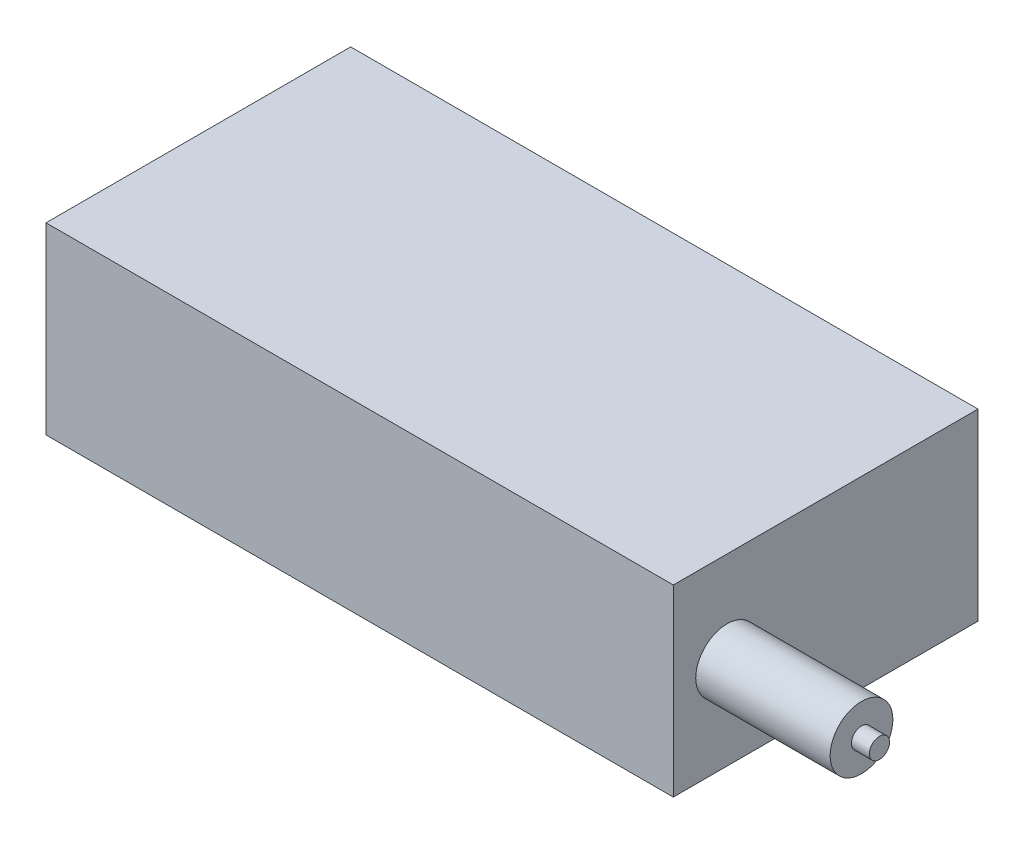
ISO-10303-21;
HEADER;
FILE_DESCRIPTION(('STEP AP214'),'2;1');
FILE_NAME('part.step','',(''),(''),'','','');
FILE_SCHEMA(('AUTOMOTIVE_DESIGN { 1 0 10303 214 1 1 1 1 }'));
ENDSEC;
DATA;
#1=APPLICATION_CONTEXT('core data for automotive mechanical design processes');
#2=APPLICATION_PROTOCOL_DEFINITION('international standard','automotive_design',2000,#1);
#3=PRODUCT_CONTEXT('',#1,'mechanical');
#4=PRODUCT('Part','Part','',(#3));
#5=PRODUCT_RELATED_PRODUCT_CATEGORY('part','',(#4));
#6=PRODUCT_DEFINITION_FORMATION('','',#4);
#7=PRODUCT_DEFINITION_CONTEXT('part definition',#1,'design');
#8=PRODUCT_DEFINITION('design','',#6,#7);
#9=PRODUCT_DEFINITION_SHAPE('','',#8);
#10=(LENGTH_UNIT() NAMED_UNIT(*) SI_UNIT(.MILLI.,.METRE.));
#11=(NAMED_UNIT(*) PLANE_ANGLE_UNIT() SI_UNIT($,.RADIAN.));
#12=(NAMED_UNIT(*) SI_UNIT($,.STERADIAN.) SOLID_ANGLE_UNIT());
#13=UNCERTAINTY_MEASURE_WITH_UNIT(LENGTH_MEASURE(1.E-05),#10,'distance_accuracy_value','');
#14=(GEOMETRIC_REPRESENTATION_CONTEXT(3) GLOBAL_UNCERTAINTY_ASSIGNED_CONTEXT((#13)) GLOBAL_UNIT_ASSIGNED_CONTEXT((#10,
#11,#12)) REPRESENTATION_CONTEXT('',''));
#15=CARTESIAN_POINT('',(0.,0.,0.));
#16=DIRECTION('',(0.,0.,1.));
#17=DIRECTION('',(1.,0.,0.));
#18=AXIS2_PLACEMENT_3D('',#15,#16,#17);
#19=CARTESIAN_POINT('',(0.,32.54375,0.));
#20=DIRECTION('',(1.,0.,0.));
#21=DIRECTION('',(0.,0.,-1.));
#22=AXIS2_PLACEMENT_3D('',#19,#20,#21);
#23=PLANE('',#22);
#24=DIRECTION('',(0.,0.,-1.));
#25=VECTOR('',#24,1.);
#26=CARTESIAN_POINT('',(0.,25.4,-18.25625));
#27=LINE('',#26,#25);
#28=CARTESIAN_POINT('',(0.,25.4,-18.25625));
#29=VERTEX_POINT('',#28);
#30=CARTESIAN_POINT('',(0.,25.4,-46.0375));
#31=VERTEX_POINT('',#30);
#32=EDGE_CURVE('E138',#29,#31,#27,.T.);
#33=ORIENTED_EDGE('',*,*,#32,.F.);
#34=DIRECTION('',(0.,1.,0.));
#35=VECTOR('',#34,1.);
#36=CARTESIAN_POINT('',(0.,6.35,-18.25625));
#37=LINE('',#36,#35);
#38=CARTESIAN_POINT('',(0.,6.35,-18.25625));
#39=VERTEX_POINT('',#38);
#40=EDGE_CURVE('E47',#39,#29,#37,.T.);
#41=ORIENTED_EDGE('',*,*,#40,.F.);
#42=DIRECTION('',(0.,0.,1.));
#43=VECTOR('',#42,1.);
#44=CARTESIAN_POINT('',(0.,6.35,-18.25625));
#45=LINE('',#44,#43);
#46=CARTESIAN_POINT('',(0.,6.35,-46.0375));
#47=VERTEX_POINT('',#46);
#48=EDGE_CURVE('E127',#47,#39,#45,.T.);
#49=ORIENTED_EDGE('',*,*,#48,.F.);
#50=DIRECTION('',(0.,-1.,0.));
#51=VECTOR('',#50,1.);
#52=CARTESIAN_POINT('',(0.,6.35,-46.0375));
#53=LINE('',#52,#51);
#54=EDGE_CURVE('E130',#31,#47,#53,.T.);
#55=ORIENTED_EDGE('',*,*,#54,.F.);
#56=EDGE_LOOP('',(#33,#41,#49,#55));
#57=FACE_BOUND('',#56,.T.);
#58=DIRECTION('',(0.,0.,1.));
#59=VECTOR('',#58,1.);
#60=CARTESIAN_POINT('',(0.,0.,0.));
#61=LINE('',#60,#59);
#62=CARTESIAN_POINT('',(0.,0.,-53.975));
#63=VERTEX_POINT('',#62);
#64=CARTESIAN_POINT('',(0.,0.,0.));
#65=VERTEX_POINT('',#64);
#66=EDGE_CURVE('E144',#63,#65,#61,.T.);
#67=ORIENTED_EDGE('',*,*,#66,.T.);
#68=DIRECTION('',(0.,-1.,0.));
#69=VECTOR('',#68,1.);
#70=CARTESIAN_POINT('',(0.,32.54375,0.));
#71=LINE('',#70,#69);
#72=CARTESIAN_POINT('',(0.,32.54375,0.));
#73=VERTEX_POINT('',#72);
#74=EDGE_CURVE('E167',#73,#65,#71,.T.);
#75=ORIENTED_EDGE('',*,*,#74,.F.);
#76=DIRECTION('',(0.,0.,1.));
#77=VECTOR('',#76,1.);
#78=CARTESIAN_POINT('',(0.,32.54375,0.));
#79=LINE('',#78,#77);
#80=CARTESIAN_POINT('',(0.,32.54375,-53.975));
#81=VERTEX_POINT('',#80);
#82=EDGE_CURVE('E148',#81,#73,#79,.T.);
#83=ORIENTED_EDGE('',*,*,#82,.F.);
#84=DIRECTION('',(0.,-1.,0.));
#85=VECTOR('',#84,1.);
#86=CARTESIAN_POINT('',(0.,32.54375,-53.975));
#87=LINE('',#86,#85);
#88=EDGE_CURVE('E154',#81,#63,#87,.T.);
#89=ORIENTED_EDGE('',*,*,#88,.T.);
#90=EDGE_LOOP('',(#67,#75,#83,#89));
#91=FACE_BOUND('',#90,.T.);
#92=ADVANCED_FACE('F32',(#57,#91),#23,.F.);
#93=CARTESIAN_POINT('',(0.,32.54375,0.));
#94=DIRECTION('',(0.,0.,-1.));
#95=DIRECTION('',(-1.,0.,0.));
#96=AXIS2_PLACEMENT_3D('',#93,#94,#95);
#97=PLANE('',#96);
#98=DIRECTION('',(1.,0.,0.));
#99=VECTOR('',#98,1.);
#100=CARTESIAN_POINT('',(0.,0.,0.));
#101=LINE('',#100,#99);
#102=CARTESIAN_POINT('',(111.125,0.,0.));
#103=VERTEX_POINT('',#102);
#104=EDGE_CURVE('E157',#65,#103,#101,.T.);
#105=ORIENTED_EDGE('',*,*,#104,.T.);
#106=DIRECTION('',(0.,-1.,0.));
#107=VECTOR('',#106,1.);
#108=CARTESIAN_POINT('',(111.125,32.54375,0.));
#109=LINE('',#108,#107);
#110=CARTESIAN_POINT('',(111.125,32.54375,0.));
#111=VERTEX_POINT('',#110);
#112=EDGE_CURVE('E165',#111,#103,#109,.T.);
#113=ORIENTED_EDGE('',*,*,#112,.F.);
#114=DIRECTION('',(1.,0.,0.));
#115=VECTOR('',#114,1.);
#116=CARTESIAN_POINT('',(0.,32.54375,0.));
#117=LINE('',#116,#115);
#118=EDGE_CURVE('E85',#73,#111,#117,.T.);
#119=ORIENTED_EDGE('',*,*,#118,.F.);
#120=ORIENTED_EDGE('',*,*,#74,.T.);
#121=EDGE_LOOP('',(#105,#113,#119,#120));
#122=FACE_BOUND('',#121,.T.);
#123=ADVANCED_FACE('F178',(#122),#97,.F.);
#124=CARTESIAN_POINT('',(111.125,32.54375,0.));
#125=DIRECTION('',(-1.,0.,0.));
#126=DIRECTION('',(0.,0.,1.));
#127=AXIS2_PLACEMENT_3D('',#124,#125,#126);
#128=PLANE('',#127);
#129=CARTESIAN_POINT('',(111.125,16.271875,-9.525));
#130=DIRECTION('',(-1.,0.,0.));
#131=DIRECTION('',(0.,0.,1.));
#132=AXIS2_PLACEMENT_3D('',#129,#130,#131);
#133=CIRCLE('',#132,5.55625);
#134=CARTESIAN_POINT('',(111.125,16.271875,-3.96875));
#135=VERTEX_POINT('',#134);
#136=EDGE_CURVE('E35',#135,#135,#133,.F.);
#137=ORIENTED_EDGE('',*,*,#136,.F.);
#138=EDGE_LOOP('',(#137));
#139=FACE_BOUND('',#138,.T.);
#140=DIRECTION('',(0.,0.,-1.));
#141=VECTOR('',#140,1.);
#142=CARTESIAN_POINT('',(111.125,0.,0.));
#143=LINE('',#142,#141);
#144=CARTESIAN_POINT('',(111.125,0.,-53.975));
#145=VERTEX_POINT('',#144);
#146=EDGE_CURVE('E159',#103,#145,#143,.T.);
#147=ORIENTED_EDGE('',*,*,#146,.T.);
#148=DIRECTION('',(0.,-1.,0.));
#149=VECTOR('',#148,1.);
#150=CARTESIAN_POINT('',(111.125,32.54375,-53.975));
#151=LINE('',#150,#149);
#152=CARTESIAN_POINT('',(111.125,32.54375,-53.975));
#153=VERTEX_POINT('',#152);
#154=EDGE_CURVE('E163',#153,#145,#151,.T.);
#155=ORIENTED_EDGE('',*,*,#154,.F.);
#156=DIRECTION('',(0.,0.,-1.));
#157=VECTOR('',#156,1.);
#158=CARTESIAN_POINT('',(111.125,32.54375,0.));
#159=LINE('',#158,#157);
#160=EDGE_CURVE('E151',#111,#153,#159,.T.);
#161=ORIENTED_EDGE('',*,*,#160,.F.);
#162=ORIENTED_EDGE('',*,*,#112,.T.);
#163=EDGE_LOOP('',(#147,#155,#161,#162));
#164=FACE_BOUND('',#163,.T.);
#165=ADVANCED_FACE('F174',(#139,#164),#128,.F.);
#166=CARTESIAN_POINT('',(0.,32.54375,-53.975));
#167=DIRECTION('',(0.,0.,1.));
#168=DIRECTION('',(1.,0.,0.));
#169=AXIS2_PLACEMENT_3D('',#166,#167,#168);
#170=PLANE('',#169);
#171=DIRECTION('',(-1.,0.,0.));
#172=VECTOR('',#171,1.);
#173=CARTESIAN_POINT('',(0.,0.,-53.975));
#174=LINE('',#173,#172);
#175=EDGE_CURVE('E77',#145,#63,#174,.T.);
#176=ORIENTED_EDGE('',*,*,#175,.T.);
#177=ORIENTED_EDGE('',*,*,#88,.F.);
#178=DIRECTION('',(-1.,0.,0.));
#179=VECTOR('',#178,1.);
#180=CARTESIAN_POINT('',(0.,32.54375,-53.975));
#181=LINE('',#180,#179);
#182=EDGE_CURVE('E56',#153,#81,#181,.T.);
#183=ORIENTED_EDGE('',*,*,#182,.F.);
#184=ORIENTED_EDGE('',*,*,#154,.T.);
#185=EDGE_LOOP('',(#176,#177,#183,#184));
#186=FACE_BOUND('',#185,.T.);
#187=ADVANCED_FACE('F177',(#186),#170,.F.);
#188=CARTESIAN_POINT('',(0.,32.54375,0.));
#189=DIRECTION('',(0.,-1.,0.));
#190=DIRECTION('',(0.,0.,-1.));
#191=AXIS2_PLACEMENT_3D('',#188,#189,#190);
#192=PLANE('',#191);
#193=ORIENTED_EDGE('',*,*,#82,.T.);
#194=ORIENTED_EDGE('',*,*,#118,.T.);
#195=ORIENTED_EDGE('',*,*,#160,.T.);
#196=ORIENTED_EDGE('',*,*,#182,.T.);
#197=EDGE_LOOP('',(#193,#194,#195,#196));
#198=FACE_BOUND('',#197,.T.);
#199=ADVANCED_FACE('F188',(#198),#192,.F.);
#200=CARTESIAN_POINT('',(0.,0.,0.));
#201=DIRECTION('',(0.,-1.,0.));
#202=DIRECTION('',(0.,0.,-1.));
#203=AXIS2_PLACEMENT_3D('',#200,#201,#202);
#204=PLANE('',#203);
#205=ORIENTED_EDGE('',*,*,#66,.F.);
#206=ORIENTED_EDGE('',*,*,#175,.F.);
#207=ORIENTED_EDGE('',*,*,#146,.F.);
#208=ORIENTED_EDGE('',*,*,#104,.F.);
#209=EDGE_LOOP('',(#205,#206,#207,#208));
#210=FACE_BOUND('',#209,.T.);
#211=ADVANCED_FACE('F185',(#210),#204,.T.);
#212=CARTESIAN_POINT('',(3.175,6.35,-18.25625));
#213=DIRECTION('',(0.,0.,1.));
#214=DIRECTION('',(1.,0.,0.));
#215=AXIS2_PLACEMENT_3D('',#212,#213,#214);
#216=PLANE('',#215);
#217=ORIENTED_EDGE('',*,*,#40,.T.);
#218=DIRECTION('',(-1.,0.,0.));
#219=VECTOR('',#218,1.);
#220=CARTESIAN_POINT('',(3.175,25.4,-18.25625));
#221=LINE('',#220,#219);
#222=CARTESIAN_POINT('',(3.175,25.4,-18.25625));
#223=VERTEX_POINT('',#222);
#224=EDGE_CURVE('E105',#223,#29,#221,.T.);
#225=ORIENTED_EDGE('',*,*,#224,.F.);
#226=DIRECTION('',(0.,1.,0.));
#227=VECTOR('',#226,1.);
#228=CARTESIAN_POINT('',(3.175,6.35,-18.25625));
#229=LINE('',#228,#227);
#230=CARTESIAN_POINT('',(3.175,6.35,-18.25625));
#231=VERTEX_POINT('',#230);
#232=EDGE_CURVE('E109',#231,#223,#229,.T.);
#233=ORIENTED_EDGE('',*,*,#232,.F.);
#234=DIRECTION('',(-1.,0.,0.));
#235=VECTOR('',#234,1.);
#236=CARTESIAN_POINT('',(3.175,6.35,-18.25625));
#237=LINE('',#236,#235);
#238=EDGE_CURVE('E142',#231,#39,#237,.T.);
#239=ORIENTED_EDGE('',*,*,#238,.T.);
#240=EDGE_LOOP('',(#217,#225,#233,#239));
#241=FACE_BOUND('',#240,.T.);
#242=ADVANCED_FACE('F107',(#241),#216,.F.);
#243=CARTESIAN_POINT('',(3.175,6.35,-18.25625));
#244=DIRECTION('',(0.,-1.,0.));
#245=DIRECTION('',(0.,0.,-1.));
#246=AXIS2_PLACEMENT_3D('',#243,#244,#245);
#247=PLANE('',#246);
#248=ORIENTED_EDGE('',*,*,#48,.T.);
#249=ORIENTED_EDGE('',*,*,#238,.F.);
#250=DIRECTION('',(0.,0.,1.));
#251=VECTOR('',#250,1.);
#252=CARTESIAN_POINT('',(3.175,6.35,-18.25625));
#253=LINE('',#252,#251);
#254=CARTESIAN_POINT('',(3.175,6.35,-46.0375));
#255=VERTEX_POINT('',#254);
#256=EDGE_CURVE('E115',#255,#231,#253,.T.);
#257=ORIENTED_EDGE('',*,*,#256,.F.);
#258=DIRECTION('',(-1.,0.,0.));
#259=VECTOR('',#258,1.);
#260=CARTESIAN_POINT('',(3.175,6.35,-46.0375));
#261=LINE('',#260,#259);
#262=EDGE_CURVE('E145',#255,#47,#261,.T.);
#263=ORIENTED_EDGE('',*,*,#262,.T.);
#264=EDGE_LOOP('',(#248,#249,#257,#263));
#265=FACE_BOUND('',#264,.T.);
#266=ADVANCED_FACE('F203',(#265),#247,.F.);
#267=CARTESIAN_POINT('',(3.175,6.35,-46.0375));
#268=DIRECTION('',(0.,0.,-1.));
#269=DIRECTION('',(-1.,0.,0.));
#270=AXIS2_PLACEMENT_3D('',#267,#268,#269);
#271=PLANE('',#270);
#272=ORIENTED_EDGE('',*,*,#54,.T.);
#273=ORIENTED_EDGE('',*,*,#262,.F.);
#274=DIRECTION('',(0.,-1.,0.));
#275=VECTOR('',#274,1.);
#276=CARTESIAN_POINT('',(3.175,6.35,-46.0375));
#277=LINE('',#276,#275);
#278=CARTESIAN_POINT('',(3.175,25.4,-46.0375));
#279=VERTEX_POINT('',#278);
#280=EDGE_CURVE('E123',#279,#255,#277,.T.);
#281=ORIENTED_EDGE('',*,*,#280,.F.);
#282=DIRECTION('',(-1.,0.,0.));
#283=VECTOR('',#282,1.);
#284=CARTESIAN_POINT('',(3.175,25.4,-46.0375));
#285=LINE('',#284,#283);
#286=EDGE_CURVE('E114',#279,#31,#285,.T.);
#287=ORIENTED_EDGE('',*,*,#286,.T.);
#288=EDGE_LOOP('',(#272,#273,#281,#287));
#289=FACE_BOUND('',#288,.T.);
#290=ADVANCED_FACE('F206',(#289),#271,.F.);
#291=CARTESIAN_POINT('',(3.175,25.4,-18.25625));
#292=DIRECTION('',(0.,1.,0.));
#293=DIRECTION('',(0.,0.,1.));
#294=AXIS2_PLACEMENT_3D('',#291,#292,#293);
#295=PLANE('',#294);
#296=ORIENTED_EDGE('',*,*,#32,.T.);
#297=ORIENTED_EDGE('',*,*,#286,.F.);
#298=DIRECTION('',(0.,0.,-1.));
#299=VECTOR('',#298,1.);
#300=CARTESIAN_POINT('',(3.175,25.4,-18.25625));
#301=LINE('',#300,#299);
#302=EDGE_CURVE('E118',#223,#279,#301,.T.);
#303=ORIENTED_EDGE('',*,*,#302,.F.);
#304=ORIENTED_EDGE('',*,*,#224,.T.);
#305=EDGE_LOOP('',(#296,#297,#303,#304));
#306=FACE_BOUND('',#305,.T.);
#307=ADVANCED_FACE('F119',(#306),#295,.F.);
#308=CARTESIAN_POINT('',(3.175,0.,0.));
#309=DIRECTION('',(-1.,0.,0.));
#310=DIRECTION('',(0.,0.,1.));
#311=AXIS2_PLACEMENT_3D('',#308,#309,#310);
#312=PLANE('',#311);
#313=ORIENTED_EDGE('',*,*,#232,.T.);
#314=ORIENTED_EDGE('',*,*,#302,.T.);
#315=ORIENTED_EDGE('',*,*,#280,.T.);
#316=ORIENTED_EDGE('',*,*,#256,.T.);
#317=EDGE_LOOP('',(#313,#314,#315,#316));
#318=FACE_BOUND('',#317,.T.);
#319=ADVANCED_FACE('F125',(#318),#312,.T.);
#320=CARTESIAN_POINT('',(134.9375,16.271875,-9.525));
#321=DIRECTION('',(-1.,0.,0.));
#322=DIRECTION('',(0.,0.,1.));
#323=AXIS2_PLACEMENT_3D('',#320,#321,#322);
#324=CYLINDRICAL_SURFACE('',#323,5.55625);
#325=CARTESIAN_POINT('',(134.9375,16.271875,-9.525));
#326=DIRECTION('',(1.,0.,0.));
#327=DIRECTION('',(0.,0.,-1.));
#328=AXIS2_PLACEMENT_3D('',#325,#326,#327);
#329=CIRCLE('',#328,5.55625);
#330=CARTESIAN_POINT('',(134.9375,16.271875,-15.08125));
#331=VERTEX_POINT('',#330);
#332=EDGE_CURVE('E133',#331,#331,#329,.T.);
#333=ORIENTED_EDGE('',*,*,#332,.F.);
#334=EDGE_LOOP('',(#333));
#335=FACE_BOUND('',#334,.T.);
#336=ORIENTED_EDGE('',*,*,#136,.T.);
#337=EDGE_LOOP('',(#336));
#338=FACE_BOUND('',#337,.T.);
#339=ADVANCED_FACE('F172',(#335,#338),#324,.T.);
#340=CARTESIAN_POINT('',(134.9375,16.271875,-9.525));
#341=DIRECTION('',(1.,0.,0.));
#342=DIRECTION('',(0.,0.,-1.));
#343=AXIS2_PLACEMENT_3D('',#340,#341,#342);
#344=PLANE('',#343);
#345=CARTESIAN_POINT('',(134.9375,16.271875,-9.525));
#346=DIRECTION('',(1.,0.,0.));
#347=DIRECTION('',(0.,0.,-1.));
#348=AXIS2_PLACEMENT_3D('',#345,#346,#347);
#349=CIRCLE('',#348,1.7859375);
#350=CARTESIAN_POINT('',(134.9375,16.271875,-11.3109375));
#351=VERTEX_POINT('',#350);
#352=EDGE_CURVE('E11',#351,#351,#349,.T.);
#353=ORIENTED_EDGE('',*,*,#352,.F.);
#354=EDGE_LOOP('',(#353));
#355=FACE_BOUND('',#354,.T.);
#356=ORIENTED_EDGE('',*,*,#332,.T.);
#357=EDGE_LOOP('',(#356));
#358=FACE_BOUND('',#357,.T.);
#359=ADVANCED_FACE('F217',(#355,#358),#344,.T.);
#360=CARTESIAN_POINT('',(138.1125,16.271875,-9.525));
#361=DIRECTION('',(-1.,0.,0.));
#362=DIRECTION('',(0.,0.,1.));
#363=AXIS2_PLACEMENT_3D('',#360,#361,#362);
#364=CYLINDRICAL_SURFACE('',#363,1.7859375);
#365=CARTESIAN_POINT('',(138.1125,16.271875,-9.525));
#366=DIRECTION('',(1.,0.,0.));
#367=DIRECTION('',(0.,0.,-1.));
#368=AXIS2_PLACEMENT_3D('',#365,#366,#367);
#369=CIRCLE('',#368,1.7859375);
#370=CARTESIAN_POINT('',(138.1125,16.271875,-11.3109375));
#371=VERTEX_POINT('',#370);
#372=EDGE_CURVE('E233',#371,#371,#369,.T.);
#373=ORIENTED_EDGE('',*,*,#372,.F.);
#374=EDGE_LOOP('',(#373));
#375=FACE_BOUND('',#374,.T.);
#376=ORIENTED_EDGE('',*,*,#352,.T.);
#377=EDGE_LOOP('',(#376));
#378=FACE_BOUND('',#377,.T.);
#379=ADVANCED_FACE('F221',(#375,#378),#364,.T.);
#380=CARTESIAN_POINT('',(138.1125,16.271875,-9.525));
#381=DIRECTION('',(1.,0.,0.));
#382=DIRECTION('',(0.,0.,-1.));
#383=AXIS2_PLACEMENT_3D('',#380,#381,#382);
#384=PLANE('',#383);
#385=ORIENTED_EDGE('',*,*,#372,.T.);
#386=EDGE_LOOP('',(#385));
#387=FACE_BOUND('',#386,.T.);
#388=ADVANCED_FACE('F225',(#387),#384,.T.);
#389=CLOSED_SHELL('',(#92,#123,#165,#187,#199,#211,#242,#266,#290,#307,#319,#339,#359,#379,#388));
#390=MANIFOLD_SOLID_BREP('B2',#389);
#391=ADVANCED_BREP_SHAPE_REPRESENTATION('',(#18,#390),#14);
#392=SHAPE_DEFINITION_REPRESENTATION(#9,#391);
ENDSEC;
END-ISO-10303-21;
